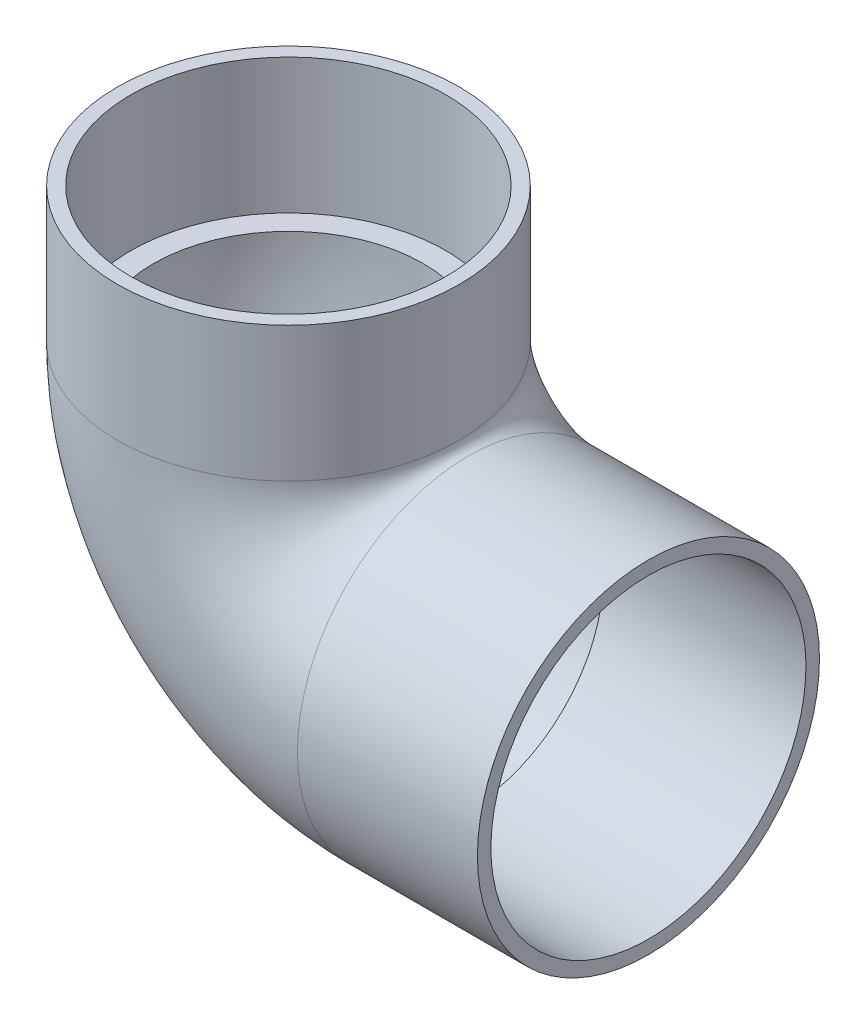
ISO-10303-21;
HEADER;
FILE_DESCRIPTION(('STEP AP214'),'2;1');
FILE_NAME('part.step','',(''),(''),'','','');
FILE_SCHEMA(('AUTOMOTIVE_DESIGN { 1 0 10303 214 1 1 1 1 }'));
ENDSEC;
DATA;
#1=APPLICATION_CONTEXT('core data for automotive mechanical design processes');
#2=APPLICATION_PROTOCOL_DEFINITION('international standard','automotive_design',2000,#1);
#3=PRODUCT_CONTEXT('',#1,'mechanical');
#4=PRODUCT('Part','Part','',(#3));
#5=PRODUCT_RELATED_PRODUCT_CATEGORY('part','',(#4));
#6=PRODUCT_DEFINITION_FORMATION('','',#4);
#7=PRODUCT_DEFINITION_CONTEXT('part definition',#1,'design');
#8=PRODUCT_DEFINITION('design','',#6,#7);
#9=PRODUCT_DEFINITION_SHAPE('','',#8);
#10=(LENGTH_UNIT() NAMED_UNIT(*) SI_UNIT(.MILLI.,.METRE.));
#11=(NAMED_UNIT(*) PLANE_ANGLE_UNIT() SI_UNIT($,.RADIAN.));
#12=(NAMED_UNIT(*) SI_UNIT($,.STERADIAN.) SOLID_ANGLE_UNIT());
#13=UNCERTAINTY_MEASURE_WITH_UNIT(LENGTH_MEASURE(1.E-05),#10,'distance_accuracy_value','');
#14=(GEOMETRIC_REPRESENTATION_CONTEXT(3) GLOBAL_UNCERTAINTY_ASSIGNED_CONTEXT((#13)) GLOBAL_UNIT_ASSIGNED_CONTEXT((#10,
#11,#12)) REPRESENTATION_CONTEXT('',''));
#15=CARTESIAN_POINT('',(0.,0.,0.));
#16=DIRECTION('',(0.,0.,1.));
#17=DIRECTION('',(1.,0.,0.));
#18=AXIS2_PLACEMENT_3D('',#15,#16,#17);
#19=CARTESIAN_POINT('',(50.8,50.8,0.));
#20=DIRECTION('',(0.,0.,1.));
#21=DIRECTION('',(1.,0.,0.));
#22=AXIS2_PLACEMENT_3D('',#19,#20,#21);
#23=TOROIDAL_SURFACE('',#22,50.8,38.1);
#24=CARTESIAN_POINT('',(0.,50.8,0.));
#25=DIRECTION('',(0.,1.,0.));
#26=DIRECTION('',(0.,0.,1.));
#27=AXIS2_PLACEMENT_3D('',#24,#25,#26);
#28=CIRCLE('',#27,38.1);
#29=CARTESIAN_POINT('',(0.,50.8,38.1));
#30=VERTEX_POINT('',#29);
#31=EDGE_CURVE('E72',#30,#30,#28,.F.);
#32=ORIENTED_EDGE('',*,*,#31,.F.);
#33=EDGE_LOOP('',(#32));
#34=FACE_BOUND('',#33,.T.);
#35=CARTESIAN_POINT('',(50.8,0.,38.1));
#36=CARTESIAN_POINT('',(50.6937506551657,-2.65553563853947E-09,38.0999999939043));
#37=CARTESIAN_POINT('',(50.5875013019026,0.000166666978049967,38.0999999990788));
#38=CARTESIAN_POINT('',(50.3198958961622,0.00100622191737926,38.0999999931356));
#39=CARTESIAN_POINT('',(50.1585404999289,0.00189682766355569,38.0999999721758));
#40=CARTESIAN_POINT('',(49.8083786046458,0.00466370244150309,38.0999997460448));
#41=CARTESIAN_POINT('',(49.6195731941363,0.00668191031325934,38.0999995101337));
#42=CARTESIAN_POINT('',(49.2816559415135,0.0112358809436007,38.0999983874677));
#43=CARTESIAN_POINT('',(49.1325413146634,0.0135737286852348,38.0999976479175));
#44=CARTESIAN_POINT('',(48.3869730297527,0.0269042750833692,38.0999921030618));
#45=CARTESIAN_POINT('',(47.7905988733239,0.0428201167667348,38.0999817564965));
#46=CARTESIAN_POINT('',(46.6093817690422,0.0847393171818097,38.0999114756402));
#47=CARTESIAN_POINT('',(46.0245319084749,0.110548300544989,38.0998524730681));
#48=CARTESIAN_POINT('',(45.176235876063,0.155300949245401,38.0996858572716));
#49=CARTESIAN_POINT('',(44.9125714836804,0.170237627843075,38.0996226999046));
#50=CARTESIAN_POINT('',(43.5944232571428,0.250041528754185,38.0992342625858));
#51=CARTESIAN_POINT('',(42.5408162058683,0.330252436695226,38.0986910836909));
#52=CARTESIAN_POINT('',(40.4347876587719,0.52326165716076,38.0965286719675));
#53=CARTESIAN_POINT('',(39.3823713631827,0.636116078279494,38.0949075801074));
#54=CARTESIAN_POINT('',(37.2814611273037,0.89393424158798,38.0897296246892));
#55=CARTESIAN_POINT('',(36.2329672569757,1.03889855374977,38.0861727267677));
#56=CARTESIAN_POINT('',(34.1396982125145,1.36057590637225,38.0760391788313));
#57=CARTESIAN_POINT('',(33.0949283884342,1.53732364707481,38.0694592159882));
#58=CARTESIAN_POINT('',(31.0110509378624,1.92183379895502,38.0519847388621));
#59=CARTESIAN_POINT('',(29.9719439258897,2.12959950932022,38.0410897654143));
#60=CARTESIAN_POINT('',(27.4600858592575,2.67014488269018,38.0076551892979));
#61=CARTESIAN_POINT('',(25.9907049224316,3.01853007362722,37.9821346291682));
#62=CARTESIAN_POINT('',(23.0674455585727,3.7743979544331,37.9144801095275));
#63=CARTESIAN_POINT('',(21.6135691766308,4.18188833941106,37.8723439855495));
#64=CARTESIAN_POINT('',(18.7225678147542,5.05349775741209,37.7659243957873));
#65=CARTESIAN_POINT('',(17.2854555443327,5.51765703886573,37.7016251290946));
#66=CARTESIAN_POINT('',(14.4311738555482,6.49928559501431,37.5448571125201));
#67=CARTESIAN_POINT('',(13.0140035712743,7.01675254684116,37.4523895897195));
#68=CARTESIAN_POINT('',(10.2014903477444,8.10167952389987,37.2327696571103));
#69=CARTESIAN_POINT('',(8.80614931241788,8.66914388155391,37.1056142394883));
#70=CARTESIAN_POINT('',(6.03953524924842,9.85032276988604,36.8096707491279));
#71=CARTESIAN_POINT('',(4.66826355399872,10.4640398514395,36.6408803790193));
#72=CARTESIAN_POINT('',(1.95335845056832,11.7330376224123,36.2544538465567));
#73=CARTESIAN_POINT('',(0.609704151673504,12.3882852400066,36.0368562086154));
#74=CARTESIAN_POINT('',(-2.04804682719716,13.7359767214538,35.5450055790321));
#75=CARTESIAN_POINT('',(-3.36214845373742,14.4284142936649,35.270762148289));
#76=CARTESIAN_POINT('',(-6.02634693434823,15.8827112718119,34.6411634817565));
#77=CARTESIAN_POINT('',(-7.37467355385028,16.6463054802084,34.2822864012727));
#78=CARTESIAN_POINT('',(-10.0303086005268,18.2015925945585,33.4824832050231));
#79=CARTESIAN_POINT('',(-11.3376184199921,18.9932845448028,33.0415598777967));
#80=CARTESIAN_POINT('',(-13.9038192139462,20.5951758364821,32.0675316949466));
#81=CARTESIAN_POINT('',(-15.1627611894055,21.4053541629482,31.5345273866293));
#82=CARTESIAN_POINT('',(-17.6258669887376,23.0343687273046,30.3649962747985));
#83=CARTESIAN_POINT('',(-18.830043124838,23.8532029676811,29.7284928882132));
#84=CARTESIAN_POINT('',(-20.9128035538612,25.3046039678709,28.4952743738652));
#85=CARTESIAN_POINT('',(-21.8041980376006,25.9380611017929,27.921240114395));
#86=CARTESIAN_POINT('',(-23.5422046128691,27.1949242621796,26.6985902251607));
#87=CARTESIAN_POINT('',(-24.3888152957501,27.8183299720545,26.049972251444));
#88=CARTESIAN_POINT('',(-26.0291577781371,29.0455089476129,24.6742214258288));
#89=CARTESIAN_POINT('',(-26.8229460974907,29.649302831788,23.9471747499307));
#90=CARTESIAN_POINT('',(-28.3499126925878,30.8273931646552,22.4102328764819));
#91=CARTESIAN_POINT('',(-29.0831129596829,31.4017002870983,21.6003679799987));
#92=CARTESIAN_POINT('',(-30.2834681125352,32.3537192155821,20.1341172535766));
#93=CARTESIAN_POINT('',(-30.7676738569283,32.7414875427048,19.498165419273));
#94=CARTESIAN_POINT('',(-31.6950717951405,33.4902656828738,18.1819999824051));
#95=CARTESIAN_POINT('',(-32.1382671369606,33.8512775493495,17.5017897839967));
#96=CARTESIAN_POINT('',(-32.9784917210067,34.5406458860298,16.0985794008729));
#97=CARTESIAN_POINT('',(-33.3755629563472,34.8690320198679,15.3756190571227));
#98=CARTESIAN_POINT('',(-34.1189252872765,35.4876263323935,13.8883626545042));
#99=CARTESIAN_POINT('',(-34.4652239013623,35.7778401630451,13.1240727387807));
#100=CARTESIAN_POINT('',(-35.0522791364928,36.2723502904148,11.6796897933719));
#101=CARTESIAN_POINT('',(-35.3010733127012,36.4829880703517,11.0050283413211));
#102=CARTESIAN_POINT('',(-35.7557950963495,36.8693598844265,9.63166348556521));
#103=CARTESIAN_POINT('',(-35.9617268227061,37.0450972722834,8.93296239950303));
#104=CARTESIAN_POINT('',(-36.3278904088649,37.3584435273626,7.51553651591122));
#105=CARTESIAN_POINT('',(-36.4881379715046,37.4960654953829,6.79681869212393));
#106=CARTESIAN_POINT('',(-36.7606670216976,37.7305698576894,5.34374692301776));
#107=CARTESIAN_POINT('',(-36.8729479366861,37.8274517656722,4.60939279116236));
#108=CARTESIAN_POINT('',(-37.0481023224899,37.9787467669774,3.12754922927256));
#109=CARTESIAN_POINT('',(-37.110783704843,38.0329947426638,2.38002008273452));
#110=CARTESIAN_POINT('',(-37.1849735823598,38.0972154727816,0.880515540766529));
#111=CARTESIAN_POINT('',(-37.1964819654283,38.1071881302274,0.128540135600616));
#112=CARTESIAN_POINT('',(-37.1681322912208,38.0826383227511,-1.37366866866446));
#113=CARTESIAN_POINT('',(-37.1282766883596,38.0481179839152,-2.12390214928493));
#114=CARTESIAN_POINT('',(-36.997871905869,37.9353448597475,-3.61660081536696));
#115=CARTESIAN_POINT('',(-36.9073240919964,37.8570932526297,-4.35906620956843));
#116=CARTESIAN_POINT('',(-36.6841495273578,37.6646891462428,-5.78501920501391));
#117=CARTESIAN_POINT('',(-36.554471839118,37.5530565452825,-6.46931427931721));
#118=CARTESIAN_POINT('',(-36.2535784932453,37.2947978363866,-7.82189611254242));
#119=CARTESIAN_POINT('',(-36.0823658510323,37.1481742687928,-8.49018402970901));
#120=CARTESIAN_POINT('',(-35.7005289473704,36.822367581756,-9.80732777930485));
#121=CARTESIAN_POINT('',(-35.4898984576844,36.643179317041,-10.4561805220488));
#122=CARTESIAN_POINT('',(-35.0316011874438,36.254976785429,-11.7316277715637));
#123=CARTESIAN_POINT('',(-34.7839274090715,36.0459568834036,-12.358218045012));
#124=CARTESIAN_POINT('',(-34.3431934459843,35.6758488479832,-13.3802869288319));
#125=CARTESIAN_POINT('',(-34.1597407349448,35.5222500583496,-13.7826858716519));
#126=CARTESIAN_POINT('',(-33.7784643825814,35.2041352627032,-14.576059153793));
#127=CARTESIAN_POINT('',(-33.580643876924,35.0396216394473,-14.9670359599495));
#128=CARTESIAN_POINT('',(-32.9665643681638,34.530855305879,-16.1226026673149));
#129=CARTESIAN_POINT('',(-32.529726486575,34.1714100835233,-16.8697387289803));
#130=CARTESIAN_POINT('',(-31.606660305524,33.4185257104732,-18.3160621247785));
#131=CARTESIAN_POINT('',(-31.1203658762607,33.0250411525928,-19.0151831085076));
#132=CARTESIAN_POINT('',(-30.1042444626382,32.2108194084242,-20.36403091197));
#133=CARTESIAN_POINT('',(-29.5744152449181,31.7900808242227,-21.0137551943267));
#134=CARTESIAN_POINT('',(-28.2591319674822,30.756694268903,-22.511306302808));
#135=CARTESIAN_POINT('',(-27.4553473099883,30.1338659384033,-23.3360595220781));
#136=CARTESIAN_POINT('',(-25.7838521502858,28.8601736509863,-24.8940482267506));
#137=CARTESIAN_POINT('',(-24.9161167605211,28.2092988206405,-25.6272477801573));
#138=CARTESIAN_POINT('',(-23.1250770597855,26.8903244233324,-27.008021003415));
#139=CARTESIAN_POINT('',(-22.2016984571057,26.2222025408042,-27.655476334066));
#140=CARTESIAN_POINT('',(-20.3081358136343,24.8792845004655,-28.8695448706101));
#141=CARTESIAN_POINT('',(-19.3379523589027,24.204488426309,-29.4361590883921));
#142=CARTESIAN_POINT('',(-17.5785286276708,23.0070439468174,-30.3764483104497));
#143=CARTESIAN_POINT('',(-16.7973204084959,22.4841040413535,-30.7649391832542));
#144=CARTESIAN_POINT('',(-15.2127192372295,21.4421821154852,-31.4999898255854));
#145=CARTESIAN_POINT('',(-14.4093236734977,20.9232005702682,-31.8465446328181));
#146=CARTESIAN_POINT('',(-12.7821342607544,19.8918575906559,-32.5007243644368));
#147=CARTESIAN_POINT('',(-11.9583307026682,19.3794994908657,-32.8083303165338));
#148=CARTESIAN_POINT('',(-10.2924814101652,18.364161092313,-33.3872593083261));
#149=CARTESIAN_POINT('',(-9.45043629076327,17.8611804784488,-33.6585835690544));
#150=CARTESIAN_POINT('',(-7.74867082905834,16.8662502587063,-34.1680008558542));
#151=CARTESIAN_POINT('',(-6.88893239108226,16.3743131442772,-34.4060577000449));
#152=CARTESIAN_POINT('',(-5.1538886794519,15.4039614148999,-34.851297620836));
#153=CARTESIAN_POINT('',(-4.27858195549904,14.9255480706523,-35.0584778040111));
#154=CARTESIAN_POINT('',(-2.51390824743565,13.9842253832514,-35.4444653889864));
#155=CARTESIAN_POINT('',(-1.624546145363,13.5213108236653,-35.6232824142835));
#156=CARTESIAN_POINT('',(0.167557304606333,12.612407062394,-35.9551276647845));
#157=CARTESIAN_POINT('',(1.07029939434739,12.1664188040944,-36.1081544542032));
#158=CARTESIAN_POINT('',(3.50255505948593,10.9976815724477,-36.4863423118897));
#159=CARTESIAN_POINT('',(5.04341246359719,10.2915506076687,-36.6903769357863));
#160=CARTESIAN_POINT('',(8.15638773632502,8.93727647082054,-37.0435515448599));
#161=CARTESIAN_POINT('',(9.72850500087707,8.28913217954723,-37.1926925897142));
#162=CARTESIAN_POINT('',(12.8986944783935,7.05708636663054,-37.4459942767651));
#163=CARTESIAN_POINT('',(14.4967272721868,6.47309617363528,-37.5502176005204));
#164=CARTESIAN_POINT('',(17.7178176002964,5.37321628418659,-37.7233161358002));
#165=CARTESIAN_POINT('',(19.3408727436353,4.85732012559124,-37.7921947033454));
#166=CARTESIAN_POINT('',(21.9278734542399,4.09788908612903,-37.8800263658633));
#167=CARTESIAN_POINT('',(22.8845804562683,3.83045544773396,-37.9078227164));
#168=CARTESIAN_POINT('',(24.8049110853233,3.32097890814033,-37.955850979585));
#169=CARTESIAN_POINT('',(25.7685345049146,3.07893524882448,-37.9760831181386));
#170=CARTESIAN_POINT('',(27.70193411533,2.62099533723904,-38.0104340511742));
#171=CARTESIAN_POINT('',(28.6717093958073,2.40509530705726,-38.0245537297046));
#172=CARTESIAN_POINT('',(30.6168689931671,2.00006315439726,-38.0480075452488));
#173=CARTESIAN_POINT('',(31.5922532150617,1.81093057999055,-38.0573417630649));
#174=CARTESIAN_POINT('',(33.7901950285764,1.4165608053465,-38.0742892842541));
#175=CARTESIAN_POINT('',(35.0141365667279,1.21893743044208,-38.0809037232884));
#176=CARTESIAN_POINT('',(37.4681188363537,0.867290548034068,-38.0905322146192));
#177=CARTESIAN_POINT('',(38.6981589037917,0.713262395345515,-38.0935466506158));
#178=CARTESIAN_POINT('',(41.4558995075915,0.418241026306414,-38.0980594947751));
#179=CARTESIAN_POINT('',(42.9848882211945,0.289039045496818,-38.0990275640827));
#180=CARTESIAN_POINT('',(45.4350457708316,0.137487447266798,-38.0997905936709));
#181=CARTESIAN_POINT('',(46.3549078009348,0.0930703705397837,-38.0998997744667));
#182=CARTESIAN_POINT('',(47.808311846266,0.042647609205805,-38.0999805779698));
#183=CARTESIAN_POINT('',(48.34157157988,0.028343557593686,-38.0999907478707));
#184=CARTESIAN_POINT('',(49.4103025153434,0.00809361965153858,-38.1000005405976));
#185=CARTESIAN_POINT('',(49.9457743484344,0.00218002863432023,-38.1000001227867));
#186=CARTESIAN_POINT('',(50.5875015861653,0.000166649862416717,-38.0999999717049));
#187=CARTESIAN_POINT('',(50.6937509681758,-2.40073043336141E-08,-38.0999999581767));
#188=CARTESIAN_POINT('',(50.8,0.,-38.1));
#189=B_SPLINE_CURVE_WITH_KNOTS('',3,(#35,#36,#37,#38,#39,#40,#41,#42,#43,#44,#45,#46,#47,#48,
#49,#50,#51,#52,#53,#54,#55,#56,#57,#58,#59,#60,#61,#62,#63,#64,#65,#66,#67,#68,#69,#70,#71,#72,
#73,#74,#75,#76,#77,#78,#79,#80,#81,#82,#83,#84,#85,#86,#87,#88,#89,#90,#91,#92,#93,#94,#95,#96,
#97,#98,#99,#100,#101,#102,#103,#104,#105,#106,#107,#108,#109,#110,#111,#112,#113,#114,#115,
#116,#117,#118,#119,#120,#121,#122,#123,#124,#125,#126,#127,#128,#129,#130,#131,#132,#133,#134,
#135,#136,#137,#138,#139,#140,#141,#142,#143,#144,#145,#146,#147,#148,#149,#150,#151,#152,#153,
#154,#155,#156,#157,#158,#159,#160,#161,#162,#163,#164,#165,#166,#167,#168,#169,#170,#171,#172,
#173,#174,#175,#176,#177,#178,#179,#180,#181,#182,#183,#184,#185,#186,#187,#188),.UNSPECIFIED.,
.F.,.F.,(4,2,2,2,2,2,2,2,2,2,2,2,2,2,2,2,2,2,2,2,2,2,2,2,2,2,2,2,2,2,2,2,2,2,2,2,2,2,2,2,2,2,2,
2,2,2,2,2,2,2,2,2,2,2,2,2,2,2,2,2,2,2,2,2,2,2,2,2,2,2,2,2,2,2,2,2,4),(0.,0.318747941169993,
0.802819714216943,1.36926493657385,1.81666311157425,3.60632076922248,5.36248281544543,
6.15474150931375,9.32413229890855,12.499003431856,15.6739309254064,18.8523459952499,
22.0310993744106,26.5606824536081,31.0908557850688,35.6242655446354,40.1574778455242,
44.6910833496477,49.2249390690343,53.7552286536705,58.2847542221976,63.0537591902478,
67.8226021017586,72.5862702410489,77.3488620842224,81.0513301524023,84.7539146103784,
88.4524713969561,92.1496797851887,94.8127213878489,97.4755584028103,100.135951747972,
102.795950738755,105.041567603783,107.28696857393,109.531596808122,111.776251835082,
114.029557960244,116.282869021299,118.53607241246,120.789215100418,122.902996826555,
125.016625138944,127.130587698656,129.244950110907,130.648957431363,132.052659252893,
134.86037265392,137.671890962669,140.483553594163,144.405384637628,148.328750073313,
152.257475100409,156.186150947306,159.236612141982,162.287433945445,165.339736157147,
168.391935620047,171.447429262867,174.503209053577,177.557949803268,180.612860559317,
185.73197588253,190.850992380077,195.962842103879,201.074206362459,204.055193325388,
207.036091253924,210.016557909366,212.996974238078,216.715588110194,220.43380560498,
225.035414065598,227.79790165197,229.398195602284,231.004632609433,231.323380550608),.UNSPECIFIED.);
#190=CARTESIAN_POINT('',(50.8,0.,38.1));
#191=VERTEX_POINT('',#190);
#192=CARTESIAN_POINT('',(44.45,0.198437500000183,38.0994832321725));
#193=VERTEX_POINT('',#192);
#194=EDGE_CURVE('E11',#191,#193,#189,.T.);
#195=ORIENTED_EDGE('',*,*,#194,.F.);
#196=CARTESIAN_POINT('',(50.8,0.,0.));
#197=DIRECTION('',(-1.,0.,0.));
#198=DIRECTION('',(0.,0.,1.));
#199=AXIS2_PLACEMENT_3D('',#196,#197,#198);
#200=CIRCLE('',#199,38.1);
#201=CARTESIAN_POINT('',(50.8,0.,-38.1));
#202=VERTEX_POINT('',#201);
#203=EDGE_CURVE('E64',#191,#202,#200,.F.);
#204=ORIENTED_EDGE('',*,*,#203,.T.);
#205=CARTESIAN_POINT('',(44.4500000000125,0.198437499998891,-38.0994832321725));
#206=VERTEX_POINT('',#205);
#207=EDGE_CURVE('E47',#206,#202,#189,.T.);
#208=ORIENTED_EDGE('',*,*,#207,.F.);
#209=CARTESIAN_POINT('',(44.45,-26.42763300704,-27.1909359510793));
#210=CARTESIAN_POINT('',(44.45,-27.1919796378004,-26.443252599978));
#211=CARTESIAN_POINT('',(44.45,-27.9247681660165,-25.6634667256889));
#212=CARTESIAN_POINT('',(44.45,-29.3224077367477,-24.0447717150186));
#213=CARTESIAN_POINT('',(44.45,-29.9872403062365,-23.2058466064999));
#214=CARTESIAN_POINT('',(44.45,-31.244642632828,-21.47403544984));
#215=CARTESIAN_POINT('',(44.45,-31.8371289677555,-20.5810888505397));
#216=CARTESIAN_POINT('',(44.45,-32.9446772484259,-18.7484834884018));
#217=CARTESIAN_POINT('',(44.45,-33.4597444921232,-17.8088279278199));
#218=CARTESIAN_POINT('',(44.45,-34.4086076807821,-15.8898113353689));
#219=CARTESIAN_POINT('',(44.45,-34.8424361243411,-14.9104663723034));
#220=CARTESIAN_POINT('',(44.45,-35.625967829376,-12.9186631079923));
#221=CARTESIAN_POINT('',(44.45,-35.9756696991678,-11.9062042592671));
#222=CARTESIAN_POINT('',(44.45,-36.5883437535576,-9.85566713124436));
#223=CARTESIAN_POINT('',(44.45,-36.8513387727646,-8.81759567466157));
#224=CARTESIAN_POINT('',(44.45,-37.2888342368522,-6.72297376824881));
#225=CARTESIAN_POINT('',(44.45,-37.4633351120391,-5.66642340829909));
#226=CARTESIAN_POINT('',(44.45,-37.7224626300264,-3.5434079180142));
#227=CARTESIAN_POINT('',(44.45,-37.807176997436,-2.47695349416429));
#228=CARTESIAN_POINT('',(44.45,-37.886426004878,-0.340698535071033));
#229=CARTESIAN_POINT('',(44.45,-37.8809606163393,0.729102001232319));
#230=CARTESIAN_POINT('',(44.45,-37.7798873715182,2.86447479205016));
#231=CARTESIAN_POINT('',(44.45,-37.684276265638,3.93004689274627));
#232=CARTESIAN_POINT('',(44.45,-37.4035932069299,6.04934233857231));
#233=CARTESIAN_POINT('',(44.45,-37.2185212784543,7.10306568692754));
#234=CARTESIAN_POINT('',(44.45,-36.7603425426466,9.1907243489376));
#235=CARTESIAN_POINT('',(44.45,-36.4872732651523,10.2246678996546));
#236=CARTESIAN_POINT('',(44.45,-35.8550348243688,12.2658857690399));
#237=CARTESIAN_POINT('',(44.45,-35.4958657007667,13.2731601000009));
#238=CARTESIAN_POINT('',(44.45,-34.6940021416757,15.2538909162089));
#239=CARTESIAN_POINT('',(44.45,-34.2513079455162,16.2273474983464));
#240=CARTESIAN_POINT('',(44.45,-33.285563544464,18.1335491447961));
#241=CARTESIAN_POINT('',(44.45,-32.7625132898403,19.066294183912));
#242=CARTESIAN_POINT('',(44.45,-31.6394515268757,20.885038545104));
#243=CARTESIAN_POINT('',(44.45,-31.0393925444514,21.7710085519195));
#244=CARTESIAN_POINT('',(44.45,-29.7668617977128,23.4893198595418));
#245=CARTESIAN_POINT('',(44.45,-29.0943900291625,24.3216611572114));
#246=CARTESIAN_POINT('',(44.45,-27.6818419744267,25.9268501793246));
#247=CARTESIAN_POINT('',(44.45,-26.941765707719,26.6996979209089));
#248=CARTESIAN_POINT('',(44.45,-25.3992925758378,28.180474753685));
#249=CARTESIAN_POINT('',(44.45,-24.5968956254406,28.8884037560974));
#250=CARTESIAN_POINT('',(44.45,-22.9339892237917,30.2356205779884));
#251=CARTESIAN_POINT('',(44.45,-22.0733767280042,30.8747812060307));
#252=CARTESIAN_POINT('',(44.45,-20.3014910559505,32.0785265086951));
#253=CARTESIAN_POINT('',(44.45,-19.3902178476009,32.6431111360874));
#254=CARTESIAN_POINT('',(44.45,-17.5234948194128,33.693806605752));
#255=CARTESIAN_POINT('',(44.45,-16.5680446313584,34.1799167937865));
#256=CARTESIAN_POINT('',(44.45,-14.6197615862739,35.0703374536754));
#257=CARTESIAN_POINT('',(44.45,-13.6269286351065,35.4746477195247));
#258=CARTESIAN_POINT('',(44.45,-11.6072909943702,36.2000520993171));
#259=CARTESIAN_POINT('',(44.45,-10.5803772098675,36.5208424742244));
#260=CARTESIAN_POINT('',(44.45,-8.50327266530472,37.0751882243939));
#261=CARTESIAN_POINT('',(44.45,-7.45308187279339,37.3087434780308));
#262=CARTESIAN_POINT('',(44.45,-5.33684881514543,37.6871570421267));
#263=CARTESIAN_POINT('',(44.45,-4.27080660788278,37.8320156763383));
#264=CARTESIAN_POINT('',(44.45,-2.13035414133484,38.0322358408985));
#265=CARTESIAN_POINT('',(44.45,-1.05594384513417,38.0875969762086));
#266=CARTESIAN_POINT('',(44.45,1.10077978502382,38.1087497740359));
#267=CARTESIAN_POINT('',(44.45,2.18309888133324,38.0739537359039));
#268=CARTESIAN_POINT('',(44.45,4.34104059463525,37.9140803344185));
#269=CARTESIAN_POINT('',(44.45,5.41666319335916,37.7890027248772));
#270=CARTESIAN_POINT('',(44.45,7.55383492734452,37.4497552750625));
#271=CARTESIAN_POINT('',(44.45,8.61538306522323,37.2355791553012));
#272=CARTESIAN_POINT('',(44.45,10.7170708797341,36.7199867338691));
#273=CARTESIAN_POINT('',(44.45,11.7572103860216,36.4185697383254));
#274=CARTESIAN_POINT('',(44.45,13.8213074046118,35.7268707088224));
#275=CARTESIAN_POINT('',(44.45,14.8449244429804,35.3355726397505));
#276=CARTESIAN_POINT('',(44.45,16.8561307921298,34.4693623377348));
#277=CARTESIAN_POINT('',(44.45,17.8437198937274,33.9944496194055));
#278=CARTESIAN_POINT('',(44.45,19.7761968177296,32.9648289003271));
#279=CARTESIAN_POINT('',(44.45,20.7210908841423,32.4101326176213));
#280=CARTESIAN_POINT('',(44.45,22.5621970472033,31.2251811784372));
#281=CARTESIAN_POINT('',(44.45,23.4584085008756,30.5949250243538));
#282=CARTESIAN_POINT('',(44.45,25.2140043636064,29.2500984763091));
#283=CARTESIAN_POINT('',(44.45,26.0722937686234,28.5340939174421));
#284=CARTESIAN_POINT('',(44.45,27.3129436495426,27.4090180222873));
#285=CARTESIAN_POINT('',(44.45,27.7187165255694,27.0254595098431));
#286=CARTESIAN_POINT('',(44.45,28.5142122144536,26.2418478723114));
#287=CARTESIAN_POINT('',(44.45,28.9039310556084,25.8417907139336));
#288=CARTESIAN_POINT('',(44.45,30.0484606586496,24.6174419607261));
#289=CARTESIAN_POINT('',(44.45,30.7781476003083,23.7694239245733));
#290=CARTESIAN_POINT('',(44.45,32.1652994537371,22.0162348826474));
#291=CARTESIAN_POINT('',(44.45,32.8227641212313,21.1110636835826));
#292=CARTESIAN_POINT('',(44.45,33.7581448042275,19.7043370293219));
#293=CARTESIAN_POINT('',(44.45,34.0646070253991,19.2215653384264));
#294=CARTESIAN_POINT('',(44.45,34.6565986014976,18.2435251057555));
#295=CARTESIAN_POINT('',(44.45,34.9421330799334,17.7482596628679));
#296=CARTESIAN_POINT('',(44.45,35.7664657388464,16.2445580490752));
#297=CARTESIAN_POINT('',(44.45,36.2730260662296,15.2181671412293));
#298=CARTESIAN_POINT('',(44.45,37.1929599395847,13.1257349801604));
#299=CARTESIAN_POINT('',(44.45,37.6064224442579,12.0597327219522));
#300=CARTESIAN_POINT('',(44.45,38.3334458663919,9.89386481728259));
#301=CARTESIAN_POINT('',(44.45,38.6470167761242,8.79400256995285));
#302=CARTESIAN_POINT('',(44.45,39.0299763181592,7.15296064553728));
#303=CARTESIAN_POINT('',(44.45,39.1411836192395,6.62126464870518));
#304=CARTESIAN_POINT('',(44.45,39.3383982131649,5.55324224745284));
#305=CARTESIAN_POINT('',(44.45,39.4244090017283,5.01691649599543));
#306=CARTESIAN_POINT('',(44.45,39.5705283088921,3.94076185053948));
#307=CARTESIAN_POINT('',(44.45,39.6306372789709,3.40093301776746));
#308=CARTESIAN_POINT('',(44.45,39.7244214521518,2.31897637464297));
#309=CARTESIAN_POINT('',(44.45,39.7580966869878,1.77684856705125));
#310=CARTESIAN_POINT('',(44.45,39.7986734882606,0.692066409604568));
#311=CARTESIAN_POINT('',(44.45,39.8055985303356,0.149412939656884));
#312=CARTESIAN_POINT('',(44.45,39.7926733709182,-0.935575899567855));
#313=CARTESIAN_POINT('',(44.45,39.7728229904932,-1.47791126669489));
#314=CARTESIAN_POINT('',(44.45,39.7065362580721,-2.56094378136492));
#315=CARTESIAN_POINT('',(44.45,39.6601006666927,-3.10164097533198));
#316=CARTESIAN_POINT('',(44.45,39.5410886905553,-4.18009814850152));
#317=CARTESIAN_POINT('',(44.45,39.4685129711772,-4.7178582021133));
#318=CARTESIAN_POINT('',(44.45,39.2348012994859,-6.18483088968482));
#319=CARTESIAN_POINT('',(44.45,39.0478360408234,-7.11004307198726));
#320=CARTESIAN_POINT('',(44.45,38.6009196177129,-8.94236842780694));
#321=CARTESIAN_POINT('',(44.45,38.3409756037671,-9.84948336518136));
#322=CARTESIAN_POINT('',(44.45,37.7523405068371,-11.6419847337302));
#323=CARTESIAN_POINT('',(44.45,37.4235885843866,-12.5273511557007));
#324=CARTESIAN_POINT('',(44.45,36.7017515469323,-14.2714222111578));
#325=CARTESIAN_POINT('',(44.45,36.3086614267656,-15.1301247641518));
#326=CARTESIAN_POINT('',(44.45,35.4222714756517,-16.8961214508224));
#327=CARTESIAN_POINT('',(44.45,34.9230384354811,-17.8004515132872));
#328=CARTESIAN_POINT('',(44.45,34.1233138152073,-19.1259012156149));
#329=CARTESIAN_POINT('',(44.45,33.8482422886949,-19.5625680425471));
#330=CARTESIAN_POINT('',(44.45,33.2815365282513,-20.4251494347666));
#331=CARTESIAN_POINT('',(44.45,32.9898990005794,-20.8510618373138));
#332=CARTESIAN_POINT('',(44.45,32.0910992380426,-22.1114427108725));
#333=CARTESIAN_POINT('',(44.45,31.4598423325786,-22.928898389737));
#334=CARTESIAN_POINT('',(44.45,30.1370606326951,-24.5135288439009));
#335=CARTESIAN_POINT('',(44.45,29.4455338087651,-25.2807019244745));
#336=CARTESIAN_POINT('',(44.45,28.3298263086073,-26.4275314625094));
#337=CARTESIAN_POINT('',(44.45,27.9251990482945,-26.82636713241));
#338=CARTESIAN_POINT('',(44.45,27.0996542213178,-27.6066116522225));
#339=CARTESIAN_POINT('',(44.45,26.6787401372296,-27.9880241900641));
#340=CARTESIAN_POINT('',(44.45,25.3923377835896,-29.1052659174531));
#341=CARTESIAN_POINT('',(44.45,24.5031520910553,-29.8141375908726));
#342=CARTESIAN_POINT('',(44.45,22.667877961861,-31.1541034038713));
#343=CARTESIAN_POINT('',(44.45,21.7217783325303,-31.785182169834));
#344=CARTESIAN_POINT('',(44.45,19.7791963126791,-32.9644041937977));
#345=CARTESIAN_POINT('',(44.45,18.7827151280168,-33.5125494355202));
#346=CARTESIAN_POINT('',(44.45,16.7509244662694,-34.5190600220163));
#347=CARTESIAN_POINT('',(44.45,15.7158077424197,-34.9778144500705));
#348=CARTESIAN_POINT('',(44.45,13.6099518274004,-35.8046734851406));
#349=CARTESIAN_POINT('',(44.45,12.5392124352615,-36.1727775806436));
#350=CARTESIAN_POINT('',(44.45,10.3700813755925,-36.8150438390441));
#351=CARTESIAN_POINT('',(44.45,9.27169382860308,-37.0892199125503));
#352=CARTESIAN_POINT('',(44.45,7.0552676869212,-37.5411896327113));
#353=CARTESIAN_POINT('',(44.45,5.93722950823405,-37.7189853172147));
#354=CARTESIAN_POINT('',(44.45,3.71682162147372,-37.9733718457016));
#355=CARTESIAN_POINT('',(44.45,2.61471727581838,-38.0522828793334));
#356=CARTESIAN_POINT('',(44.45,0.407790578620184,-38.1157266490258));
#357=CARTESIAN_POINT('',(44.45,-0.697031744342073,-38.1002603732965));
#358=CARTESIAN_POINT('',(44.45,-2.90152586791574,-37.974765871947));
#359=CARTESIAN_POINT('',(44.45,-4.00119655990693,-37.8647181549358));
#360=CARTESIAN_POINT('',(44.45,-6.18701059162921,-37.5506034871351));
#361=CARTESIAN_POINT('',(44.45,-7.27315426828841,-37.3465388829284));
#362=CARTESIAN_POINT('',(44.45,-9.40757845710013,-36.8494867861067));
#363=CARTESIAN_POINT('',(44.45,-10.4561831635508,-36.5578906745891));
#364=CARTESIAN_POINT('',(44.45,-12.5249113625808,-35.8866857071519));
#365=CARTESIAN_POINT('',(44.45,-13.5450331388937,-35.5070715603888));
#366=CARTESIAN_POINT('',(44.45,-15.5480801271894,-34.662950378715));
#367=CARTESIAN_POINT('',(44.45,-16.5310491736428,-34.1985474114142));
#368=CARTESIAN_POINT('',(44.45,-18.4535991958193,-33.1879758563579));
#369=CARTESIAN_POINT('',(44.45,-19.3931924425136,-32.6418305812029));
#370=CARTESIAN_POINT('',(44.45,-21.4073769869345,-31.3531736443912));
#371=CARTESIAN_POINT('',(44.45,-22.4709044843169,-30.5932803134181));
#372=CARTESIAN_POINT('',(44.45,-24.5145075356733,-28.9685155597339));
#373=CARTESIAN_POINT('',(44.45,-25.4945833600506,-28.1036444771978));
#374=CARTESIAN_POINT('',(44.45,-26.42763300704,-27.1909359510793));
#375=B_SPLINE_CURVE_WITH_KNOTS('',3,(#209,#210,#211,#212,#213,#214,#215,#216,#217,#218,#219,
#220,#221,#222,#223,#224,#225,#226,#227,#228,#229,#230,#231,#232,#233,#234,#235,#236,#237,#238,
#239,#240,#241,#242,#243,#244,#245,#246,#247,#248,#249,#250,#251,#252,#253,#254,#255,#256,#257,
#258,#259,#260,#261,#262,#263,#264,#265,#266,#267,#268,#269,#270,#271,#272,#273,#274,#275,#276,
#277,#278,#279,#280,#281,#282,#283,#284,#285,#286,#287,#288,#289,#290,#291,#292,#293,#294,#295,
#296,#297,#298,#299,#300,#301,#302,#303,#304,#305,#306,#307,#308,#309,#310,#311,#312,#313,#314,
#315,#316,#317,#318,#319,#320,#321,#322,#323,#324,#325,#326,#327,#328,#329,#330,#331,#332,#333,
#334,#335,#336,#337,#338,#339,#340,#341,#342,#343,#344,#345,#346,#347,#348,#349,#350,#351,#352,
#353,#354,#355,#356,#357,#358,#359,#360,#361,#362,#363,#364,#365,#366,#367,#368,#369,#370,#371,
#372,#373,#374),.UNSPECIFIED.,.T.,.F.,(4,2,2,2,2,2,2,2,2,2,2,2,2,2,2,2,2,2,2,2,2,2,2,2,2,2,2,2,
2,2,2,2,2,2,2,2,2,2,2,2,2,2,2,2,2,2,2,2,2,2,2,2,2,2,2,2,2,2,2,2,2,2,2,2,2,2,2,2,2,2,2,2,2,2,2,2,
2,2,2,2,2,2,4),(0.,3.20655607733781,6.4139815138464,9.62507117751583,12.8359409992931,
16.0455235946449,19.2551592816371,22.4639490212936,25.6727231579305,28.8783593099542,
32.0839964775917,35.289749207341,38.495501064446,41.6998875114093,44.9042724813388,
48.1086482696948,51.3130260411995,54.5193888123367,57.7257517710426,60.9321138059566,
64.1384802256598,67.3506786097265,70.5628790280996,73.7751062250528,76.9873415115861,
80.2111006009934,83.4348641850237,86.6586160018876,89.8823820482271,93.1272154013686,
96.3720576028493,99.6171285331866,102.862225273995,106.145987323169,109.429768435304,
112.713067740553,115.996410399462,119.345418943274,121.020100924007,122.695194756058,
126.047388998057,129.399594577763,131.114617274005,132.829218687843,136.25824387342,
139.683978450308,143.109370239334,144.738487694577,146.367379021867,147.996241955817,
149.625102934293,151.25253411933,152.879976180078,154.507371681197,156.134725760962,
158.963086040147,161.791169291553,164.621763758555,167.45257853522,170.54808439253,
172.096017371432,173.644259203266,176.739542054369,179.834929175372,181.538919329726,
183.24254711558,186.649642617258,190.057410361339,193.465096580715,196.857601843297,
200.25012624834,203.64214800784,207.034098044281,210.34487243683,213.655612162835,
216.967034331393,220.278373854108,223.539638439451,226.801099113196,230.058583340982,
233.315140310468,237.229445143379,241.143737292525),.UNSPECIFIED.);
#376=EDGE_CURVE('E37',#193,#206,#375,.T.);
#377=ORIENTED_EDGE('',*,*,#376,.F.);
#378=EDGE_LOOP('',(#195,#204,#208,#377));
#379=FACE_BOUND('',#378,.T.);
#380=ADVANCED_FACE('F33',(#34,#379),#23,.F.);
#381=CARTESIAN_POINT('',(0.,88.9,0.));
#382=DIRECTION('',(0.,-1.,0.));
#383=DIRECTION('',(1.,0.,0.));
#384=AXIS2_PLACEMENT_3D('',#381,#382,#383);
#385=CYLINDRICAL_SURFACE('',#384,48.26);
#386=CARTESIAN_POINT('',(0.,50.8,0.));
#387=DIRECTION('',(0.,1.,0.));
#388=DIRECTION('',(0.,0.,1.));
#389=AXIS2_PLACEMENT_3D('',#386,#387,#388);
#390=CIRCLE('',#389,48.26);
#391=CARTESIAN_POINT('',(-48.26,50.8,0.));
#392=VERTEX_POINT('',#391);
#393=EDGE_CURVE('E135',#392,#392,#390,.T.);
#394=ORIENTED_EDGE('',*,*,#393,.T.);
#395=EDGE_LOOP('',(#394));
#396=FACE_BOUND('',#395,.T.);
#397=CARTESIAN_POINT('',(0.,88.9,0.));
#398=DIRECTION('',(0.,1.,0.));
#399=DIRECTION('',(0.,0.,1.));
#400=AXIS2_PLACEMENT_3D('',#397,#398,#399);
#401=CIRCLE('',#400,48.26);
#402=CARTESIAN_POINT('',(0.,88.9,48.26));
#403=VERTEX_POINT('',#402);
#404=EDGE_CURVE('E137',#403,#403,#401,.T.);
#405=ORIENTED_EDGE('',*,*,#404,.F.);
#406=EDGE_LOOP('',(#405));
#407=FACE_BOUND('',#406,.T.);
#408=ADVANCED_FACE('F95',(#396,#407),#385,.T.);
#409=CARTESIAN_POINT('',(50.8,50.8,0.));
#410=DIRECTION('',(0.,0.,1.));
#411=DIRECTION('',(1.,0.,0.));
#412=AXIS2_PLACEMENT_3D('',#409,#410,#411);
#413=TOROIDAL_SURFACE('',#412,50.8,48.26);
#414=CARTESIAN_POINT('',(50.8,0.,0.));
#415=DIRECTION('',(-1.,0.,0.));
#416=DIRECTION('',(0.,0.,1.));
#417=AXIS2_PLACEMENT_3D('',#414,#415,#416);
#418=CIRCLE('',#417,48.26);
#419=CARTESIAN_POINT('',(50.8,-48.26,0.));
#420=VERTEX_POINT('',#419);
#421=EDGE_CURVE('E80',#420,#420,#418,.T.);
#422=CARTESIAN_POINT('',(50.8,50.8,0.));
#423=DIRECTION('',(0.,0.,1.));
#424=DIRECTION('',(1.,0.,0.));
#425=AXIS2_PLACEMENT_3D('',#422,#423,#424);
#426=CIRCLE('',#425,99.06);
#427=EDGE_CURVE('',#392,#420,#426,.T.);
#428=ORIENTED_EDGE('',*,*,#393,.F.);
#429=ORIENTED_EDGE('',*,*,#421,.T.);
#430=ORIENTED_EDGE('',*,*,#427,.T.);
#431=ORIENTED_EDGE('',*,*,#427,.F.);
#432=EDGE_LOOP('',(#428,#430,#429,#431));
#433=FACE_BOUND('',#432,.T.);
#434=ADVANCED_FACE('F110',(#433),#413,.T.);
#435=CARTESIAN_POINT('',(50.8,0.,0.));
#436=DIRECTION('',(1.,0.,0.));
#437=DIRECTION('',(0.,1.,0.));
#438=AXIS2_PLACEMENT_3D('',#435,#436,#437);
#439=CYLINDRICAL_SURFACE('',#438,48.26);
#440=CARTESIAN_POINT('',(101.6,0.,0.));
#441=DIRECTION('',(-1.,0.,0.));
#442=DIRECTION('',(0.,0.,1.));
#443=AXIS2_PLACEMENT_3D('',#440,#441,#442);
#444=CIRCLE('',#443,48.26);
#445=CARTESIAN_POINT('',(101.6,0.,48.26));
#446=VERTEX_POINT('',#445);
#447=EDGE_CURVE('E143',#446,#446,#444,.T.);
#448=ORIENTED_EDGE('',*,*,#447,.T.);
#449=EDGE_LOOP('',(#448));
#450=FACE_BOUND('',#449,.T.);
#451=ORIENTED_EDGE('',*,*,#421,.F.);
#452=EDGE_LOOP('',(#451));
#453=FACE_BOUND('',#452,.T.);
#454=ADVANCED_FACE('F35',(#450,#453),#439,.T.);
#455=CARTESIAN_POINT('',(0.,88.9,0.));
#456=DIRECTION('',(0.,1.,0.));
#457=DIRECTION('',(0.,0.,1.));
#458=AXIS2_PLACEMENT_3D('',#455,#456,#457);
#459=PLANE('',#458);
#460=CARTESIAN_POINT('',(0.,88.9,0.));
#461=DIRECTION('',(0.,1.,0.));
#462=DIRECTION('',(0.,0.,1.));
#463=AXIS2_PLACEMENT_3D('',#460,#461,#462);
#464=CIRCLE('',#463,44.45);
#465=CARTESIAN_POINT('',(0.,88.9,44.45));
#466=VERTEX_POINT('',#465);
#467=EDGE_CURVE('E150',#466,#466,#464,.T.);
#468=ORIENTED_EDGE('',*,*,#467,.F.);
#469=EDGE_LOOP('',(#468));
#470=FACE_BOUND('',#469,.T.);
#471=ORIENTED_EDGE('',*,*,#404,.T.);
#472=EDGE_LOOP('',(#471));
#473=FACE_BOUND('',#472,.T.);
#474=ADVANCED_FACE('F115',(#470,#473),#459,.T.);
#475=CARTESIAN_POINT('',(101.6,0.,0.));
#476=DIRECTION('',(-1.,0.,0.));
#477=DIRECTION('',(0.,0.,1.));
#478=AXIS2_PLACEMENT_3D('',#475,#476,#477);
#479=PLANE('',#478);
#480=CARTESIAN_POINT('',(101.6,0.,0.));
#481=DIRECTION('',(1.,0.,0.));
#482=DIRECTION('',(0.,1.,0.));
#483=AXIS2_PLACEMENT_3D('',#480,#481,#482);
#484=CIRCLE('',#483,44.45);
#485=CARTESIAN_POINT('',(101.6,44.45,0.));
#486=VERTEX_POINT('',#485);
#487=EDGE_CURVE('E69',#486,#486,#484,.T.);
#488=ORIENTED_EDGE('',*,*,#487,.F.);
#489=EDGE_LOOP('',(#488));
#490=FACE_BOUND('',#489,.T.);
#491=ORIENTED_EDGE('',*,*,#447,.F.);
#492=EDGE_LOOP('',(#491));
#493=FACE_BOUND('',#492,.T.);
#494=ADVANCED_FACE('F93',(#490,#493),#479,.F.);
#495=CARTESIAN_POINT('',(44.45,0.,0.));
#496=DIRECTION('',(1.,0.,0.));
#497=DIRECTION('',(0.,1.,0.));
#498=AXIS2_PLACEMENT_3D('',#495,#496,#497);
#499=PLANE('',#498);
#500=CARTESIAN_POINT('',(44.45,0.,0.));
#501=DIRECTION('',(1.,0.,0.));
#502=DIRECTION('',(0.,1.,0.));
#503=AXIS2_PLACEMENT_3D('',#500,#501,#502);
#504=CIRCLE('',#503,44.45);
#505=CARTESIAN_POINT('',(44.45,44.45,0.));
#506=VERTEX_POINT('',#505);
#507=EDGE_CURVE('E136',#506,#506,#504,.T.);
#508=ORIENTED_EDGE('',*,*,#507,.T.);
#509=EDGE_LOOP('',(#508));
#510=FACE_BOUND('',#509,.T.);
#511=ORIENTED_EDGE('',*,*,#376,.T.);
#512=CARTESIAN_POINT('',(44.45,0.,0.));
#513=DIRECTION('',(1.,0.,0.));
#514=DIRECTION('',(0.,1.,0.));
#515=AXIS2_PLACEMENT_3D('',#512,#513,#514);
#516=CIRCLE('',#515,38.1);
#517=EDGE_CURVE('E53',#193,#206,#516,.T.);
#518=ORIENTED_EDGE('',*,*,#517,.F.);
#519=EDGE_LOOP('',(#511,#518));
#520=FACE_BOUND('',#519,.T.);
#521=ADVANCED_FACE('F68',(#510,#520),#499,.T.);
#522=CARTESIAN_POINT('',(44.45,0.,0.));
#523=DIRECTION('',(1.,0.,0.));
#524=DIRECTION('',(0.,1.,0.));
#525=AXIS2_PLACEMENT_3D('',#522,#523,#524);
#526=CYLINDRICAL_SURFACE('',#525,38.1);
#527=ORIENTED_EDGE('',*,*,#194,.T.);
#528=ORIENTED_EDGE('',*,*,#517,.T.);
#529=ORIENTED_EDGE('',*,*,#207,.T.);
#530=ORIENTED_EDGE('',*,*,#203,.F.);
#531=EDGE_LOOP('',(#527,#528,#529,#530));
#532=FACE_BOUND('',#531,.T.);
#533=ADVANCED_FACE('F63',(#532),#526,.T.);
#534=CARTESIAN_POINT('',(44.45,0.,0.));
#535=DIRECTION('',(1.,0.,0.));
#536=DIRECTION('',(0.,1.,0.));
#537=AXIS2_PLACEMENT_3D('',#534,#535,#536);
#538=CYLINDRICAL_SURFACE('',#537,44.45);
#539=ORIENTED_EDGE('',*,*,#507,.F.);
#540=EDGE_LOOP('',(#539));
#541=FACE_BOUND('',#540,.T.);
#542=ORIENTED_EDGE('',*,*,#487,.T.);
#543=EDGE_LOOP('',(#542));
#544=FACE_BOUND('',#543,.T.);
#545=ADVANCED_FACE('F88',(#541,#544),#538,.F.);
#546=CARTESIAN_POINT('',(0.,50.8,0.));
#547=DIRECTION('',(0.,1.,0.));
#548=DIRECTION('',(0.,0.,1.));
#549=AXIS2_PLACEMENT_3D('',#546,#547,#548);
#550=CYLINDRICAL_SURFACE('',#549,44.45);
#551=CARTESIAN_POINT('',(0.,50.8,0.));
#552=DIRECTION('',(0.,1.,0.));
#553=DIRECTION('',(0.,0.,1.));
#554=AXIS2_PLACEMENT_3D('',#551,#552,#553);
#555=CIRCLE('',#554,44.45);
#556=CARTESIAN_POINT('',(0.,50.8,44.45));
#557=VERTEX_POINT('',#556);
#558=EDGE_CURVE('E70',#557,#557,#555,.T.);
#559=ORIENTED_EDGE('',*,*,#558,.F.);
#560=EDGE_LOOP('',(#559));
#561=FACE_BOUND('',#560,.T.);
#562=ORIENTED_EDGE('',*,*,#467,.T.);
#563=EDGE_LOOP('',(#562));
#564=FACE_BOUND('',#563,.T.);
#565=ADVANCED_FACE('F89',(#561,#564),#550,.F.);
#566=CARTESIAN_POINT('',(0.,50.8,0.));
#567=DIRECTION('',(0.,1.,0.));
#568=DIRECTION('',(0.,0.,1.));
#569=AXIS2_PLACEMENT_3D('',#566,#567,#568);
#570=PLANE('',#569);
#571=ORIENTED_EDGE('',*,*,#31,.T.);
#572=EDGE_LOOP('',(#571));
#573=FACE_BOUND('',#572,.T.);
#574=ORIENTED_EDGE('',*,*,#558,.T.);
#575=EDGE_LOOP('',(#574));
#576=FACE_BOUND('',#575,.T.);
#577=ADVANCED_FACE('F101',(#573,#576),#570,.T.);
#578=CLOSED_SHELL('',(#380,#408,#434,#454,#474,#494,#521,#533,#545,#565,#577));
#579=MANIFOLD_SOLID_BREP('B2',#578);
#580=ADVANCED_BREP_SHAPE_REPRESENTATION('',(#18,#579),#14);
#581=SHAPE_DEFINITION_REPRESENTATION(#9,#580);
ENDSEC;
END-ISO-10303-21;
